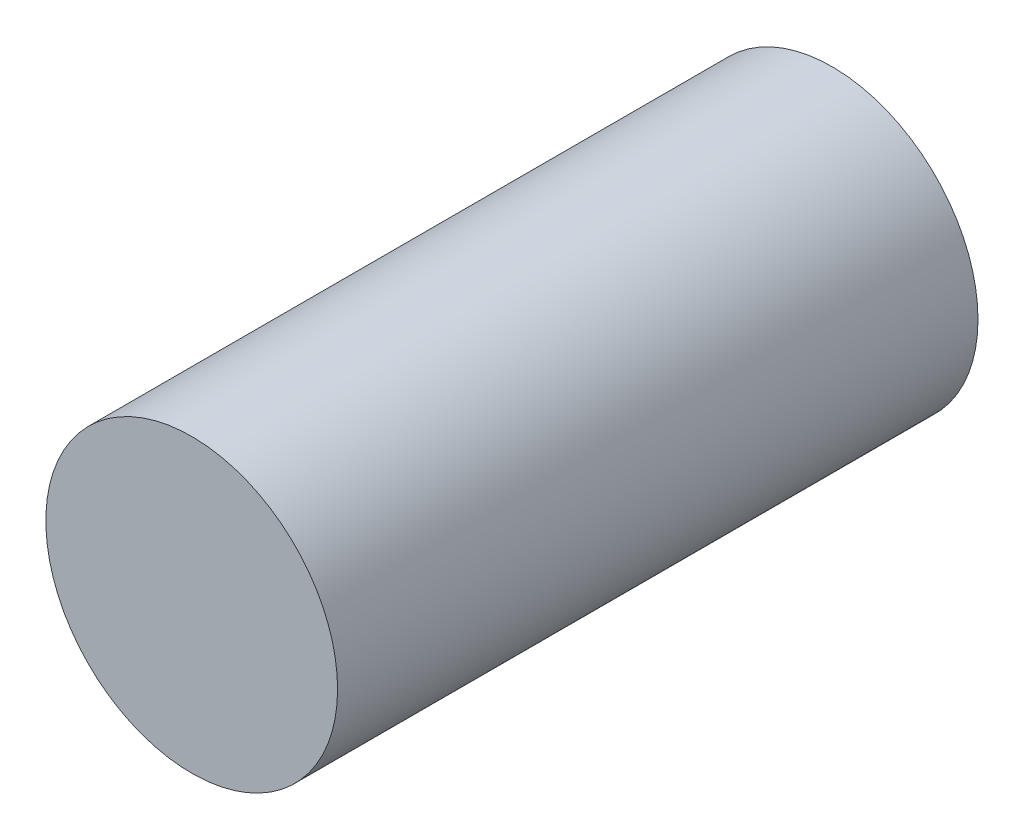
ISO-10303-21;
HEADER;
FILE_DESCRIPTION(('STEP AP214'),'2;1');
FILE_NAME('part.step','',(''),(''),'','','');
FILE_SCHEMA(('AUTOMOTIVE_DESIGN { 1 0 10303 214 1 1 1 1 }'));
ENDSEC;
DATA;
#1=APPLICATION_CONTEXT('core data for automotive mechanical design processes');
#2=APPLICATION_PROTOCOL_DEFINITION('international standard','automotive_design',2000,#1);
#3=PRODUCT_CONTEXT('',#1,'mechanical');
#4=PRODUCT('Part','Part','',(#3));
#5=PRODUCT_RELATED_PRODUCT_CATEGORY('part','',(#4));
#6=PRODUCT_DEFINITION_FORMATION('','',#4);
#7=PRODUCT_DEFINITION_CONTEXT('part definition',#1,'design');
#8=PRODUCT_DEFINITION('design','',#6,#7);
#9=PRODUCT_DEFINITION_SHAPE('','',#8);
#10=(LENGTH_UNIT() NAMED_UNIT(*) SI_UNIT(.MILLI.,.METRE.));
#11=(NAMED_UNIT(*) PLANE_ANGLE_UNIT() SI_UNIT($,.RADIAN.));
#12=(NAMED_UNIT(*) SI_UNIT($,.STERADIAN.) SOLID_ANGLE_UNIT());
#13=UNCERTAINTY_MEASURE_WITH_UNIT(LENGTH_MEASURE(1.E-05),#10,'distance_accuracy_value','');
#14=(GEOMETRIC_REPRESENTATION_CONTEXT(3) GLOBAL_UNCERTAINTY_ASSIGNED_CONTEXT((#13)) GLOBAL_UNIT_ASSIGNED_CONTEXT((#10,
#11,#12)) REPRESENTATION_CONTEXT('',''));
#15=CARTESIAN_POINT('',(0.,0.,0.));
#16=DIRECTION('',(0.,0.,1.));
#17=DIRECTION('',(1.,0.,0.));
#18=AXIS2_PLACEMENT_3D('',#15,#16,#17);
#19=CARTESIAN_POINT('',(-10.16,1.27,0.1));
#20=DIRECTION('',(0.,0.,1.));
#21=DIRECTION('',(1.,0.,0.));
#22=AXIS2_PLACEMENT_3D('',#19,#20,#21);
#23=PLANE('',#22);
#24=CARTESIAN_POINT('',(-10.16,1.27,0.1));
#25=DIRECTION('',(0.,0.,1.));
#26=DIRECTION('',(1.,0.,0.));
#27=AXIS2_PLACEMENT_3D('',#24,#25,#26);
#28=CIRCLE('',#27,0.41);
#29=CARTESIAN_POINT('',(-9.75,1.27,0.1));
#30=VERTEX_POINT('',#29);
#31=EDGE_CURVE('E17',#30,#30,#28,.F.);
#32=ORIENTED_EDGE('',*,*,#31,.F.);
#33=EDGE_LOOP('',(#32));
#34=FACE_BOUND('',#33,.T.);
#35=ADVANCED_FACE('F14',(#34),#23,.T.);
#36=CARTESIAN_POINT('',(-10.16,1.27,-1.7));
#37=DIRECTION('',(0.,0.,1.));
#38=DIRECTION('',(1.,0.,0.));
#39=AXIS2_PLACEMENT_3D('',#36,#37,#38);
#40=PLANE('',#39);
#41=CARTESIAN_POINT('',(-10.16,1.27,-1.7));
#42=DIRECTION('',(0.,0.,1.));
#43=DIRECTION('',(1.,0.,0.));
#44=AXIS2_PLACEMENT_3D('',#41,#42,#43);
#45=CIRCLE('',#44,0.41);
#46=CARTESIAN_POINT('',(-9.75,1.27,-1.7));
#47=VERTEX_POINT('',#46);
#48=EDGE_CURVE('E10',#47,#47,#45,.T.);
#49=ORIENTED_EDGE('',*,*,#48,.F.);
#50=EDGE_LOOP('',(#49));
#51=FACE_BOUND('',#50,.T.);
#52=ADVANCED_FACE('F29',(#51),#40,.F.);
#53=CARTESIAN_POINT('',(-10.16,1.27,-1.7));
#54=DIRECTION('',(0.,0.,1.));
#55=DIRECTION('',(1.,0.,0.));
#56=AXIS2_PLACEMENT_3D('',#53,#54,#55);
#57=CYLINDRICAL_SURFACE('',#56,0.41);
#58=ORIENTED_EDGE('',*,*,#48,.T.);
#59=EDGE_LOOP('',(#58));
#60=FACE_BOUND('',#59,.T.);
#61=ORIENTED_EDGE('',*,*,#31,.T.);
#62=EDGE_LOOP('',(#61));
#63=FACE_BOUND('',#62,.T.);
#64=ADVANCED_FACE('F26',(#60,#63),#57,.T.);
#65=CLOSED_SHELL('',(#35,#52,#64));
#66=MANIFOLD_SOLID_BREP('B1',#65);
#67=ADVANCED_BREP_SHAPE_REPRESENTATION('',(#18,#66),#14);
#68=SHAPE_DEFINITION_REPRESENTATION(#9,#67);
ENDSEC;
END-ISO-10303-21;
